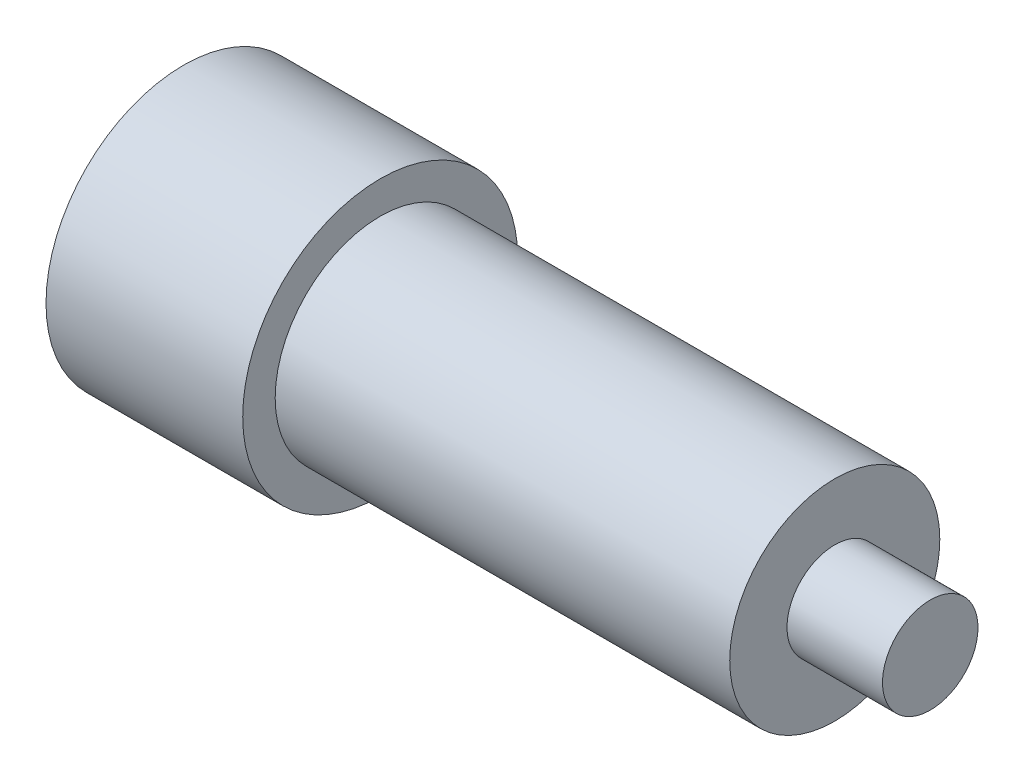
ISO-10303-21;
HEADER;
FILE_DESCRIPTION(('STEP AP214'),'2;1');
FILE_NAME('part.step','',(''),(''),'','','');
FILE_SCHEMA(('AUTOMOTIVE_DESIGN { 1 0 10303 214 1 1 1 1 }'));
ENDSEC;
DATA;
#1=APPLICATION_CONTEXT('core data for automotive mechanical design processes');
#2=APPLICATION_PROTOCOL_DEFINITION('international standard','automotive_design',2000,#1);
#3=PRODUCT_CONTEXT('',#1,'mechanical');
#4=PRODUCT('Part','Part','',(#3));
#5=PRODUCT_RELATED_PRODUCT_CATEGORY('part','',(#4));
#6=PRODUCT_DEFINITION_FORMATION('','',#4);
#7=PRODUCT_DEFINITION_CONTEXT('part definition',#1,'design');
#8=PRODUCT_DEFINITION('design','',#6,#7);
#9=PRODUCT_DEFINITION_SHAPE('','',#8);
#10=(LENGTH_UNIT() NAMED_UNIT(*) SI_UNIT(.MILLI.,.METRE.));
#11=(NAMED_UNIT(*) PLANE_ANGLE_UNIT() SI_UNIT($,.RADIAN.));
#12=(NAMED_UNIT(*) SI_UNIT($,.STERADIAN.) SOLID_ANGLE_UNIT());
#13=UNCERTAINTY_MEASURE_WITH_UNIT(LENGTH_MEASURE(1.E-05),#10,'distance_accuracy_value','');
#14=(GEOMETRIC_REPRESENTATION_CONTEXT(3) GLOBAL_UNCERTAINTY_ASSIGNED_CONTEXT((#13)) GLOBAL_UNIT_ASSIGNED_CONTEXT((#10,
#11,#12)) REPRESENTATION_CONTEXT('',''));
#15=CARTESIAN_POINT('',(0.,0.,0.));
#16=DIRECTION('',(0.,0.,1.));
#17=DIRECTION('',(1.,0.,0.));
#18=AXIS2_PLACEMENT_3D('',#15,#16,#17);
#19=CARTESIAN_POINT('',(23.8,0.,0.));
#20=DIRECTION('',(1.,0.,0.));
#21=DIRECTION('',(0.,0.,-1.));
#22=AXIS2_PLACEMENT_3D('',#19,#20,#21);
#23=PLANE('',#22);
#24=CARTESIAN_POINT('',(23.8,0.,0.));
#25=DIRECTION('',(1.,0.,0.));
#26=DIRECTION('',(0.,0.,-1.));
#27=AXIS2_PLACEMENT_3D('',#24,#25,#26);
#28=CIRCLE('',#27,5.5);
#29=CARTESIAN_POINT('',(23.8,0.,-5.5));
#30=VERTEX_POINT('',#29);
#31=EDGE_CURVE('E10',#30,#30,#28,.T.);
#32=ORIENTED_EDGE('',*,*,#31,.T.);
#33=EDGE_LOOP('',(#32));
#34=FACE_BOUND('',#33,.T.);
#35=CARTESIAN_POINT('',(23.8,0.,0.));
#36=DIRECTION('',(1.,0.,0.));
#37=DIRECTION('',(0.,0.,-1.));
#38=AXIS2_PLACEMENT_3D('',#35,#36,#37);
#39=CIRCLE('',#38,2.5);
#40=CARTESIAN_POINT('',(23.8,0.,-2.5));
#41=VERTEX_POINT('',#40);
#42=EDGE_CURVE('E52',#41,#41,#39,.T.);
#43=ORIENTED_EDGE('',*,*,#42,.F.);
#44=EDGE_LOOP('',(#43));
#45=FACE_BOUND('',#44,.T.);
#46=ADVANCED_FACE('F31',(#34,#45),#23,.T.);
#47=CARTESIAN_POINT('',(23.8,0.,0.));
#48=DIRECTION('',(-1.,0.,0.));
#49=DIRECTION('',(0.,0.,1.));
#50=AXIS2_PLACEMENT_3D('',#47,#48,#49);
#51=CYLINDRICAL_SURFACE('',#50,5.5);
#52=ORIENTED_EDGE('',*,*,#31,.F.);
#53=EDGE_LOOP('',(#52));
#54=FACE_BOUND('',#53,.T.);
#55=CARTESIAN_POINT('',(0.,0.,0.));
#56=DIRECTION('',(-1.,0.,0.));
#57=DIRECTION('',(0.,0.,1.));
#58=AXIS2_PLACEMENT_3D('',#55,#56,#57);
#59=CIRCLE('',#58,5.5);
#60=CARTESIAN_POINT('',(0.,0.,5.5));
#61=VERTEX_POINT('',#60);
#62=EDGE_CURVE('E38',#61,#61,#59,.T.);
#63=ORIENTED_EDGE('',*,*,#62,.F.);
#64=EDGE_LOOP('',(#63));
#65=FACE_BOUND('',#64,.T.);
#66=ADVANCED_FACE('F33',(#54,#65),#51,.T.);
#67=CARTESIAN_POINT('',(0.,0.,0.));
#68=DIRECTION('',(-1.,0.,0.));
#69=DIRECTION('',(0.,0.,1.));
#70=AXIS2_PLACEMENT_3D('',#67,#68,#69);
#71=PLANE('',#70);
#72=CARTESIAN_POINT('',(0.,0.,0.));
#73=DIRECTION('',(-1.,0.,0.));
#74=DIRECTION('',(0.,0.,1.));
#75=AXIS2_PLACEMENT_3D('',#72,#73,#74);
#76=CIRCLE('',#75,7.2);
#77=CARTESIAN_POINT('',(0.,0.,7.2));
#78=VERTEX_POINT('',#77);
#79=EDGE_CURVE('E46',#78,#78,#76,.T.);
#80=ORIENTED_EDGE('',*,*,#79,.F.);
#81=EDGE_LOOP('',(#80));
#82=FACE_BOUND('',#81,.T.);
#83=ORIENTED_EDGE('',*,*,#62,.T.);
#84=EDGE_LOOP('',(#83));
#85=FACE_BOUND('',#84,.T.);
#86=ADVANCED_FACE('F71',(#82,#85),#71,.F.);
#87=CARTESIAN_POINT('',(-10.3,0.,0.));
#88=DIRECTION('',(1.,0.,0.));
#89=DIRECTION('',(0.,0.,-1.));
#90=AXIS2_PLACEMENT_3D('',#87,#88,#89);
#91=CYLINDRICAL_SURFACE('',#90,7.2);
#92=CARTESIAN_POINT('',(-10.3,0.,0.));
#93=DIRECTION('',(-1.,0.,0.));
#94=DIRECTION('',(0.,0.,1.));
#95=AXIS2_PLACEMENT_3D('',#92,#93,#94);
#96=CIRCLE('',#95,7.2);
#97=CARTESIAN_POINT('',(-10.3,0.,7.2));
#98=VERTEX_POINT('',#97);
#99=EDGE_CURVE('E42',#98,#98,#96,.T.);
#100=ORIENTED_EDGE('',*,*,#99,.F.);
#101=EDGE_LOOP('',(#100));
#102=FACE_BOUND('',#101,.T.);
#103=ORIENTED_EDGE('',*,*,#79,.T.);
#104=EDGE_LOOP('',(#103));
#105=FACE_BOUND('',#104,.T.);
#106=ADVANCED_FACE('F74',(#102,#105),#91,.T.);
#107=CARTESIAN_POINT('',(-10.3,0.,0.));
#108=DIRECTION('',(-1.,0.,0.));
#109=DIRECTION('',(0.,0.,1.));
#110=AXIS2_PLACEMENT_3D('',#107,#108,#109);
#111=PLANE('',#110);
#112=ORIENTED_EDGE('',*,*,#99,.T.);
#113=EDGE_LOOP('',(#112));
#114=FACE_BOUND('',#113,.T.);
#115=ADVANCED_FACE('F63',(#114),#111,.T.);
#116=CARTESIAN_POINT('',(28.8,0.,0.));
#117=DIRECTION('',(-1.,0.,0.));
#118=DIRECTION('',(0.,0.,1.));
#119=AXIS2_PLACEMENT_3D('',#116,#117,#118);
#120=CYLINDRICAL_SURFACE('',#119,2.5);
#121=CARTESIAN_POINT('',(28.8,0.,0.));
#122=DIRECTION('',(1.,0.,0.));
#123=DIRECTION('',(0.,0.,-1.));
#124=AXIS2_PLACEMENT_3D('',#121,#122,#123);
#125=CIRCLE('',#124,2.5);
#126=CARTESIAN_POINT('',(28.8,0.,-2.5));
#127=VERTEX_POINT('',#126);
#128=EDGE_CURVE('E50',#127,#127,#125,.T.);
#129=ORIENTED_EDGE('',*,*,#128,.F.);
#130=EDGE_LOOP('',(#129));
#131=FACE_BOUND('',#130,.T.);
#132=ORIENTED_EDGE('',*,*,#42,.T.);
#133=EDGE_LOOP('',(#132));
#134=FACE_BOUND('',#133,.T.);
#135=ADVANCED_FACE('F60',(#131,#134),#120,.T.);
#136=CARTESIAN_POINT('',(28.8,0.,0.));
#137=DIRECTION('',(1.,0.,0.));
#138=DIRECTION('',(0.,0.,-1.));
#139=AXIS2_PLACEMENT_3D('',#136,#137,#138);
#140=PLANE('',#139);
#141=ORIENTED_EDGE('',*,*,#128,.T.);
#142=EDGE_LOOP('',(#141));
#143=FACE_BOUND('',#142,.T.);
#144=ADVANCED_FACE('F58',(#143),#140,.T.);
#145=CLOSED_SHELL('',(#46,#66,#86,#106,#115,#135,#144));
#146=MANIFOLD_SOLID_BREP('B2',#145);
#147=ADVANCED_BREP_SHAPE_REPRESENTATION('',(#18,#146),#14);
#148=SHAPE_DEFINITION_REPRESENTATION(#9,#147);
ENDSEC;
END-ISO-10303-21;
